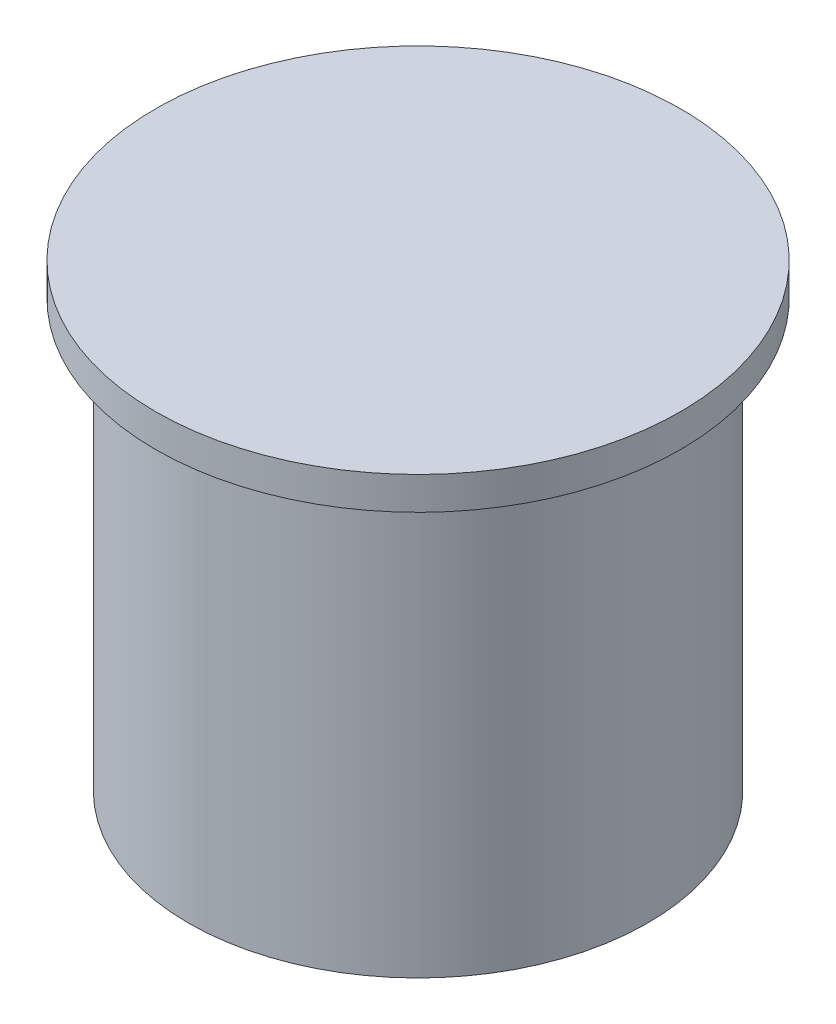
ISO-10303-21;
HEADER;
FILE_DESCRIPTION(('STEP AP214'),'2;1');
FILE_NAME('part.step','',(''),(''),'','','');
FILE_SCHEMA(('AUTOMOTIVE_DESIGN { 1 0 10303 214 1 1 1 1 }'));
ENDSEC;
DATA;
#1=APPLICATION_CONTEXT('core data for automotive mechanical design processes');
#2=APPLICATION_PROTOCOL_DEFINITION('international standard','automotive_design',2000,#1);
#3=PRODUCT_CONTEXT('',#1,'mechanical');
#4=PRODUCT('Part','Part','',(#3));
#5=PRODUCT_RELATED_PRODUCT_CATEGORY('part','',(#4));
#6=PRODUCT_DEFINITION_FORMATION('','',#4);
#7=PRODUCT_DEFINITION_CONTEXT('part definition',#1,'design');
#8=PRODUCT_DEFINITION('design','',#6,#7);
#9=PRODUCT_DEFINITION_SHAPE('','',#8);
#10=(LENGTH_UNIT() NAMED_UNIT(*) SI_UNIT(.MILLI.,.METRE.));
#11=(NAMED_UNIT(*) PLANE_ANGLE_UNIT() SI_UNIT($,.RADIAN.));
#12=(NAMED_UNIT(*) SI_UNIT($,.STERADIAN.) SOLID_ANGLE_UNIT());
#13=UNCERTAINTY_MEASURE_WITH_UNIT(LENGTH_MEASURE(1.E-05),#10,'distance_accuracy_value','');
#14=(GEOMETRIC_REPRESENTATION_CONTEXT(3) GLOBAL_UNCERTAINTY_ASSIGNED_CONTEXT((#13)) GLOBAL_UNIT_ASSIGNED_CONTEXT((#10,
#11,#12)) REPRESENTATION_CONTEXT('',''));
#15=CARTESIAN_POINT('',(0.,0.,0.));
#16=DIRECTION('',(0.,0.,1.));
#17=DIRECTION('',(1.,0.,0.));
#18=AXIS2_PLACEMENT_3D('',#15,#16,#17);
#19=CARTESIAN_POINT('',(-8.,0.,0.));
#20=DIRECTION('',(0.,1.,0.));
#21=DIRECTION('',(0.,0.,1.));
#22=AXIS2_PLACEMENT_3D('',#19,#20,#21);
#23=PLANE('',#22);
#24=CARTESIAN_POINT('',(0.,0.,0.));
#25=DIRECTION('',(0.,1.,0.));
#26=DIRECTION('',(0.,0.,1.));
#27=AXIS2_PLACEMENT_3D('',#24,#25,#26);
#28=CIRCLE('',#27,8.);
#29=CARTESIAN_POINT('',(0.,0.,8.));
#30=VERTEX_POINT('',#29);
#31=EDGE_CURVE('E19',#30,#30,#28,.F.);
#32=ORIENTED_EDGE('',*,*,#31,.F.);
#33=EDGE_LOOP('',(#32));
#34=FACE_BOUND('',#33,.T.);
#35=ADVANCED_FACE('F16',(#34),#23,.T.);
#36=CARTESIAN_POINT('',(0.,6.62621359223302,0.));
#37=DIRECTION('',(0.,1.,0.));
#38=DIRECTION('',(0.,0.,1.));
#39=AXIS2_PLACEMENT_3D('',#36,#37,#38);
#40=CYLINDRICAL_SURFACE('',#39,8.);
#41=CARTESIAN_POINT('',(0.,-1.,0.));
#42=DIRECTION('',(0.,1.,0.));
#43=DIRECTION('',(0.,0.,1.));
#44=AXIS2_PLACEMENT_3D('',#41,#42,#43);
#45=CIRCLE('',#44,8.);
#46=CARTESIAN_POINT('',(0.,-1.,8.));
#47=VERTEX_POINT('',#46);
#48=EDGE_CURVE('E28',#47,#47,#45,.F.);
#49=ORIENTED_EDGE('',*,*,#48,.F.);
#50=EDGE_LOOP('',(#49));
#51=FACE_BOUND('',#50,.T.);
#52=ORIENTED_EDGE('',*,*,#31,.T.);
#53=EDGE_LOOP('',(#52));
#54=FACE_BOUND('',#53,.T.);
#55=ADVANCED_FACE('F36',(#51,#54),#40,.T.);
#56=CARTESIAN_POINT('',(0.,-14.,0.));
#57=DIRECTION('',(0.,-1.,0.));
#58=DIRECTION('',(0.,0.,-1.));
#59=AXIS2_PLACEMENT_3D('',#56,#57,#58);
#60=PLANE('',#59);
#61=CARTESIAN_POINT('',(0.,-14.,0.));
#62=DIRECTION('',(0.,1.,0.));
#63=DIRECTION('',(0.,0.,1.));
#64=AXIS2_PLACEMENT_3D('',#61,#62,#63);
#65=CIRCLE('',#64,7.);
#66=CARTESIAN_POINT('',(0.,-14.,7.));
#67=VERTEX_POINT('',#66);
#68=EDGE_CURVE('E23',#67,#67,#65,.T.);
#69=ORIENTED_EDGE('',*,*,#68,.F.);
#70=EDGE_LOOP('',(#69));
#71=FACE_BOUND('',#70,.T.);
#72=ADVANCED_FACE('F42',(#71),#60,.T.);
#73=CARTESIAN_POINT('',(-7.,-1.,0.));
#74=DIRECTION('',(0.,-1.,0.));
#75=DIRECTION('',(0.,0.,-1.));
#76=AXIS2_PLACEMENT_3D('',#73,#74,#75);
#77=PLANE('',#76);
#78=ORIENTED_EDGE('',*,*,#48,.T.);
#79=EDGE_LOOP('',(#78));
#80=FACE_BOUND('',#79,.T.);
#81=CARTESIAN_POINT('',(0.,-1.,0.));
#82=DIRECTION('',(0.,1.,0.));
#83=DIRECTION('',(0.,0.,1.));
#84=AXIS2_PLACEMENT_3D('',#81,#82,#83);
#85=CIRCLE('',#84,7.);
#86=CARTESIAN_POINT('',(0.,-1.,7.));
#87=VERTEX_POINT('',#86);
#88=EDGE_CURVE('E10',#87,#87,#85,.F.);
#89=ORIENTED_EDGE('',*,*,#88,.F.);
#90=EDGE_LOOP('',(#89));
#91=FACE_BOUND('',#90,.T.);
#92=ADVANCED_FACE('F46',(#80,#91),#77,.T.);
#93=CARTESIAN_POINT('',(0.,6.62621359223302,0.));
#94=DIRECTION('',(0.,1.,0.));
#95=DIRECTION('',(0.,0.,1.));
#96=AXIS2_PLACEMENT_3D('',#93,#94,#95);
#97=CYLINDRICAL_SURFACE('',#96,7.);
#98=ORIENTED_EDGE('',*,*,#88,.T.);
#99=EDGE_LOOP('',(#98));
#100=FACE_BOUND('',#99,.T.);
#101=ORIENTED_EDGE('',*,*,#68,.T.);
#102=EDGE_LOOP('',(#101));
#103=FACE_BOUND('',#102,.T.);
#104=ADVANCED_FACE('F44',(#100,#103),#97,.T.);
#105=CLOSED_SHELL('',(#35,#55,#72,#92,#104));
#106=MANIFOLD_SOLID_BREP('B1',#105);
#107=ADVANCED_BREP_SHAPE_REPRESENTATION('',(#18,#106),#14);
#108=SHAPE_DEFINITION_REPRESENTATION(#9,#107);
ENDSEC;
END-ISO-10303-21;
